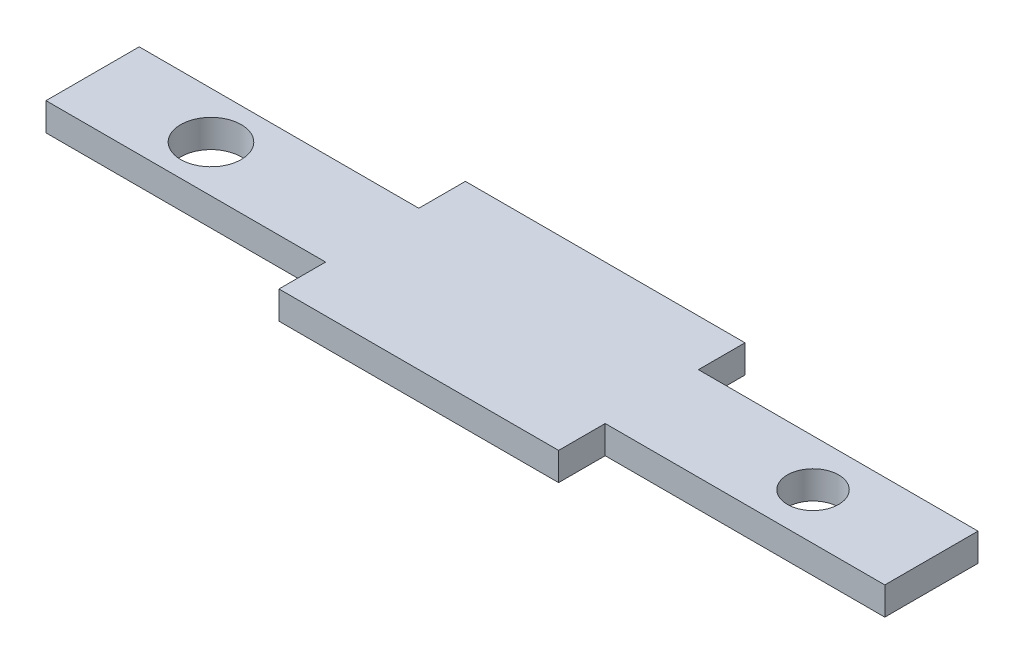
ISO-10303-21;
HEADER;
FILE_DESCRIPTION(('STEP AP214'),'2;1');
FILE_NAME('part.step','',(''),(''),'','','');
FILE_SCHEMA(('AUTOMOTIVE_DESIGN { 1 0 10303 214 1 1 1 1 }'));
ENDSEC;
DATA;
#1=APPLICATION_CONTEXT('core data for automotive mechanical design processes');
#2=APPLICATION_PROTOCOL_DEFINITION('international standard','automotive_design',2000,#1);
#3=PRODUCT_CONTEXT('',#1,'mechanical');
#4=PRODUCT('Part','Part','',(#3));
#5=PRODUCT_RELATED_PRODUCT_CATEGORY('part','',(#4));
#6=PRODUCT_DEFINITION_FORMATION('','',#4);
#7=PRODUCT_DEFINITION_CONTEXT('part definition',#1,'design');
#8=PRODUCT_DEFINITION('design','',#6,#7);
#9=PRODUCT_DEFINITION_SHAPE('','',#8);
#10=(LENGTH_UNIT() NAMED_UNIT(*) SI_UNIT(.MILLI.,.METRE.));
#11=(NAMED_UNIT(*) PLANE_ANGLE_UNIT() SI_UNIT($,.RADIAN.));
#12=(NAMED_UNIT(*) SI_UNIT($,.STERADIAN.) SOLID_ANGLE_UNIT());
#13=UNCERTAINTY_MEASURE_WITH_UNIT(LENGTH_MEASURE(1.E-05),#10,'distance_accuracy_value','');
#14=(GEOMETRIC_REPRESENTATION_CONTEXT(3) GLOBAL_UNCERTAINTY_ASSIGNED_CONTEXT((#13)) GLOBAL_UNIT_ASSIGNED_CONTEXT((#10,
#11,#12)) REPRESENTATION_CONTEXT('',''));
#15=CARTESIAN_POINT('',(0.,0.,0.));
#16=DIRECTION('',(0.,0.,1.));
#17=DIRECTION('',(1.,0.,0.));
#18=AXIS2_PLACEMENT_3D('',#15,#16,#17);
#19=CARTESIAN_POINT('',(0.,3.,0.));
#20=DIRECTION('',(0.,-1.,0.));
#21=DIRECTION('',(0.,0.,-1.));
#22=AXIS2_PLACEMENT_3D('',#19,#20,#21);
#23=PLANE('',#22);
#24=CARTESIAN_POINT('',(-19.7780658465076,3.,-5.));
#25=DIRECTION('',(0.,1.,0.));
#26=DIRECTION('',(0.,0.,1.));
#27=AXIS2_PLACEMENT_3D('',#24,#25,#26);
#28=CIRCLE('',#27,3.25);
#29=CARTESIAN_POINT('',(-19.7780658465076,3.,-1.75));
#30=VERTEX_POINT('',#29);
#31=EDGE_CURVE('E158',#30,#30,#28,.T.);
#32=ORIENTED_EDGE('',*,*,#31,.F.);
#33=EDGE_LOOP('',(#32));
#34=FACE_BOUND('',#33,.T.);
#35=DIRECTION('',(1.,0.,0.));
#36=VECTOR('',#35,1.);
#37=CARTESIAN_POINT('',(-2.47806584650756,3.,0.));
#38=LINE('',#37,#36);
#39=CARTESIAN_POINT('',(-32.4780658465076,3.,0.));
#40=VERTEX_POINT('',#39);
#41=CARTESIAN_POINT('',(-2.47806584650756,3.,0.));
#42=VERTEX_POINT('',#41);
#43=EDGE_CURVE('E177',#40,#42,#38,.T.);
#44=ORIENTED_EDGE('',*,*,#43,.T.);
#45=DIRECTION('',(0.,0.,1.));
#46=VECTOR('',#45,1.);
#47=CARTESIAN_POINT('',(-2.47806584650756,3.,4.99999999999999));
#48=LINE('',#47,#46);
#49=CARTESIAN_POINT('',(-2.47806584650756,3.,4.99999999999999));
#50=VERTEX_POINT('',#49);
#51=EDGE_CURVE('E105',#42,#50,#48,.T.);
#52=ORIENTED_EDGE('',*,*,#51,.T.);
#53=DIRECTION('',(1.,0.,0.));
#54=VECTOR('',#53,1.);
#55=CARTESIAN_POINT('',(27.5219341534924,3.,4.99999999999999));
#56=LINE('',#55,#54);
#57=CARTESIAN_POINT('',(27.5219341534924,3.,4.99999999999999));
#58=VERTEX_POINT('',#57);
#59=EDGE_CURVE('E204',#50,#58,#56,.T.);
#60=ORIENTED_EDGE('',*,*,#59,.T.);
#61=DIRECTION('',(0.,0.,-1.));
#62=VECTOR('',#61,1.);
#63=CARTESIAN_POINT('',(27.5219341534924,3.,0.));
#64=LINE('',#63,#62);
#65=CARTESIAN_POINT('',(27.5219341534924,3.,0.));
#66=VERTEX_POINT('',#65);
#67=EDGE_CURVE('E223',#58,#66,#64,.T.);
#68=ORIENTED_EDGE('',*,*,#67,.T.);
#69=DIRECTION('',(1.,0.,0.));
#70=VECTOR('',#69,1.);
#71=CARTESIAN_POINT('',(57.5219341534924,3.,0.));
#72=LINE('',#71,#70);
#73=CARTESIAN_POINT('',(57.5219341534924,3.,0.));
#74=VERTEX_POINT('',#73);
#75=EDGE_CURVE('E220',#66,#74,#72,.T.);
#76=ORIENTED_EDGE('',*,*,#75,.T.);
#77=DIRECTION('',(0.,0.,-1.));
#78=VECTOR('',#77,1.);
#79=CARTESIAN_POINT('',(57.5219341534924,3.,-10.));
#80=LINE('',#79,#78);
#81=CARTESIAN_POINT('',(57.5219341534924,3.,-10.));
#82=VERTEX_POINT('',#81);
#83=EDGE_CURVE('E222',#74,#82,#80,.T.);
#84=ORIENTED_EDGE('',*,*,#83,.T.);
#85=DIRECTION('',(-1.,0.,0.));
#86=VECTOR('',#85,1.);
#87=CARTESIAN_POINT('',(27.5219341534924,3.,-10.));
#88=LINE('',#87,#86);
#89=CARTESIAN_POINT('',(27.5219341534924,3.,-10.));
#90=VERTEX_POINT('',#89);
#91=EDGE_CURVE('E225',#82,#90,#88,.T.);
#92=ORIENTED_EDGE('',*,*,#91,.T.);
#93=DIRECTION('',(0.,0.,-1.));
#94=VECTOR('',#93,1.);
#95=CARTESIAN_POINT('',(27.5219341534924,3.,-15.));
#96=LINE('',#95,#94);
#97=CARTESIAN_POINT('',(27.5219341534924,3.,-15.));
#98=VERTEX_POINT('',#97);
#99=EDGE_CURVE('E231',#90,#98,#96,.T.);
#100=ORIENTED_EDGE('',*,*,#99,.T.);
#101=DIRECTION('',(-1.,0.,0.));
#102=VECTOR('',#101,1.);
#103=CARTESIAN_POINT('',(-2.47806584650756,3.,-15.));
#104=LINE('',#103,#102);
#105=CARTESIAN_POINT('',(-2.47806584650756,3.,-15.));
#106=VERTEX_POINT('',#105);
#107=EDGE_CURVE('E136',#98,#106,#104,.T.);
#108=ORIENTED_EDGE('',*,*,#107,.T.);
#109=DIRECTION('',(0.,0.,1.));
#110=VECTOR('',#109,1.);
#111=CARTESIAN_POINT('',(-2.47806584650756,3.,-10.));
#112=LINE('',#111,#110);
#113=CARTESIAN_POINT('',(-2.47806584650756,3.,-10.));
#114=VERTEX_POINT('',#113);
#115=EDGE_CURVE('E130',#106,#114,#112,.T.);
#116=ORIENTED_EDGE('',*,*,#115,.T.);
#117=DIRECTION('',(-1.,0.,0.));
#118=VECTOR('',#117,1.);
#119=CARTESIAN_POINT('',(-32.4780658465076,3.,-10.));
#120=LINE('',#119,#118);
#121=CARTESIAN_POINT('',(-32.4780658465076,3.,-10.));
#122=VERTEX_POINT('',#121);
#123=EDGE_CURVE('E134',#114,#122,#120,.T.);
#124=ORIENTED_EDGE('',*,*,#123,.T.);
#125=DIRECTION('',(0.,0.,1.));
#126=VECTOR('',#125,1.);
#127=CARTESIAN_POINT('',(-32.4780658465076,3.,0.));
#128=LINE('',#127,#126);
#129=EDGE_CURVE('E50',#122,#40,#128,.T.);
#130=ORIENTED_EDGE('',*,*,#129,.T.);
#131=EDGE_LOOP('',(#44,#52,#60,#68,#76,#84,#92,#100,#108,#116,#124,#130));
#132=FACE_BOUND('',#131,.T.);
#133=CARTESIAN_POINT('',(44.8219341534924,3.,-5.));
#134=DIRECTION('',(0.,1.,0.));
#135=DIRECTION('',(0.,0.,1.));
#136=AXIS2_PLACEMENT_3D('',#133,#134,#135);
#137=CIRCLE('',#136,2.75);
#138=CARTESIAN_POINT('',(44.8219341534924,3.,-2.25));
#139=VERTEX_POINT('',#138);
#140=EDGE_CURVE('E274',#139,#139,#137,.T.);
#141=ORIENTED_EDGE('',*,*,#140,.F.);
#142=EDGE_LOOP('',(#141));
#143=FACE_BOUND('',#142,.T.);
#144=ADVANCED_FACE('F33',(#34,#132,#143),#23,.F.);
#145=CARTESIAN_POINT('',(0.,0.,0.));
#146=DIRECTION('',(0.,-1.,0.));
#147=DIRECTION('',(0.,0.,-1.));
#148=AXIS2_PLACEMENT_3D('',#145,#146,#147);
#149=PLANE('',#148);
#150=CARTESIAN_POINT('',(-19.7780658465076,0.,-5.));
#151=DIRECTION('',(0.,1.,0.));
#152=DIRECTION('',(0.,0.,1.));
#153=AXIS2_PLACEMENT_3D('',#150,#151,#152);
#154=CIRCLE('',#153,3.25);
#155=CARTESIAN_POINT('',(-19.7780658465076,0.,-1.75));
#156=VERTEX_POINT('',#155);
#157=EDGE_CURVE('E279',#156,#156,#154,.T.);
#158=ORIENTED_EDGE('',*,*,#157,.T.);
#159=EDGE_LOOP('',(#158));
#160=FACE_BOUND('',#159,.T.);
#161=DIRECTION('',(1.,0.,0.));
#162=VECTOR('',#161,1.);
#163=CARTESIAN_POINT('',(-2.47806584650756,0.,0.));
#164=LINE('',#163,#162);
#165=CARTESIAN_POINT('',(-32.4780658465076,0.,0.));
#166=VERTEX_POINT('',#165);
#167=CARTESIAN_POINT('',(-2.47806584650756,0.,0.));
#168=VERTEX_POINT('',#167);
#169=EDGE_CURVE('E154',#166,#168,#164,.T.);
#170=ORIENTED_EDGE('',*,*,#169,.F.);
#171=DIRECTION('',(0.,0.,1.));
#172=VECTOR('',#171,1.);
#173=CARTESIAN_POINT('',(-32.4780658465076,0.,0.));
#174=LINE('',#173,#172);
#175=CARTESIAN_POINT('',(-32.4780658465076,0.,-10.));
#176=VERTEX_POINT('',#175);
#177=EDGE_CURVE('E97',#176,#166,#174,.T.);
#178=ORIENTED_EDGE('',*,*,#177,.F.);
#179=DIRECTION('',(-1.,0.,0.));
#180=VECTOR('',#179,1.);
#181=CARTESIAN_POINT('',(-32.4780658465076,0.,-10.));
#182=LINE('',#181,#180);
#183=CARTESIAN_POINT('',(-2.47806584650756,0.,-10.));
#184=VERTEX_POINT('',#183);
#185=EDGE_CURVE('E91',#184,#176,#182,.T.);
#186=ORIENTED_EDGE('',*,*,#185,.F.);
#187=DIRECTION('',(0.,0.,1.));
#188=VECTOR('',#187,1.);
#189=CARTESIAN_POINT('',(-2.47806584650756,0.,-10.));
#190=LINE('',#189,#188);
#191=CARTESIAN_POINT('',(-2.47806584650756,0.,-15.));
#192=VERTEX_POINT('',#191);
#193=EDGE_CURVE('E144',#192,#184,#190,.T.);
#194=ORIENTED_EDGE('',*,*,#193,.F.);
#195=DIRECTION('',(-1.,0.,0.));
#196=VECTOR('',#195,1.);
#197=CARTESIAN_POINT('',(-2.47806584650756,0.,-15.));
#198=LINE('',#197,#196);
#199=CARTESIAN_POINT('',(27.5219341534924,0.,-15.));
#200=VERTEX_POINT('',#199);
#201=EDGE_CURVE('E172',#200,#192,#198,.T.);
#202=ORIENTED_EDGE('',*,*,#201,.F.);
#203=DIRECTION('',(0.,0.,-1.));
#204=VECTOR('',#203,1.);
#205=CARTESIAN_POINT('',(27.5219341534924,0.,-15.));
#206=LINE('',#205,#204);
#207=CARTESIAN_POINT('',(27.5219341534924,0.,-10.));
#208=VERTEX_POINT('',#207);
#209=EDGE_CURVE('E170',#208,#200,#206,.T.);
#210=ORIENTED_EDGE('',*,*,#209,.F.);
#211=DIRECTION('',(-1.,0.,0.));
#212=VECTOR('',#211,1.);
#213=CARTESIAN_POINT('',(27.5219341534924,0.,-10.));
#214=LINE('',#213,#212);
#215=CARTESIAN_POINT('',(57.5219341534924,0.,-10.));
#216=VERTEX_POINT('',#215);
#217=EDGE_CURVE('E168',#216,#208,#214,.T.);
#218=ORIENTED_EDGE('',*,*,#217,.F.);
#219=DIRECTION('',(0.,0.,-1.));
#220=VECTOR('',#219,1.);
#221=CARTESIAN_POINT('',(57.5219341534924,0.,-10.));
#222=LINE('',#221,#220);
#223=CARTESIAN_POINT('',(57.5219341534924,0.,0.));
#224=VERTEX_POINT('',#223);
#225=EDGE_CURVE('E166',#224,#216,#222,.T.);
#226=ORIENTED_EDGE('',*,*,#225,.F.);
#227=DIRECTION('',(1.,0.,0.));
#228=VECTOR('',#227,1.);
#229=CARTESIAN_POINT('',(57.5219341534924,0.,0.));
#230=LINE('',#229,#228);
#231=CARTESIAN_POINT('',(27.5219341534924,0.,0.));
#232=VERTEX_POINT('',#231);
#233=EDGE_CURVE('E164',#232,#224,#230,.T.);
#234=ORIENTED_EDGE('',*,*,#233,.F.);
#235=DIRECTION('',(0.,0.,-1.));
#236=VECTOR('',#235,1.);
#237=CARTESIAN_POINT('',(27.5219341534924,0.,0.));
#238=LINE('',#237,#236);
#239=CARTESIAN_POINT('',(27.5219341534924,0.,4.99999999999999));
#240=VERTEX_POINT('',#239);
#241=EDGE_CURVE('E162',#240,#232,#238,.T.);
#242=ORIENTED_EDGE('',*,*,#241,.F.);
#243=DIRECTION('',(1.,0.,0.));
#244=VECTOR('',#243,1.);
#245=CARTESIAN_POINT('',(27.5219341534924,0.,4.99999999999999));
#246=LINE('',#245,#244);
#247=CARTESIAN_POINT('',(-2.47806584650756,0.,4.99999999999999));
#248=VERTEX_POINT('',#247);
#249=EDGE_CURVE('E160',#248,#240,#246,.T.);
#250=ORIENTED_EDGE('',*,*,#249,.F.);
#251=DIRECTION('',(0.,0.,1.));
#252=VECTOR('',#251,1.);
#253=CARTESIAN_POINT('',(-2.47806584650756,0.,4.99999999999999));
#254=LINE('',#253,#252);
#255=EDGE_CURVE('E157',#168,#248,#254,.T.);
#256=ORIENTED_EDGE('',*,*,#255,.F.);
#257=EDGE_LOOP('',(#170,#178,#186,#194,#202,#210,#218,#226,#234,#242,#250,#256));
#258=FACE_BOUND('',#257,.T.);
#259=CARTESIAN_POINT('',(44.8219341534924,0.,-5.));
#260=DIRECTION('',(0.,1.,0.));
#261=DIRECTION('',(0.,0.,1.));
#262=AXIS2_PLACEMENT_3D('',#259,#260,#261);
#263=CIRCLE('',#262,2.75);
#264=CARTESIAN_POINT('',(44.8219341534924,0.,-2.25));
#265=VERTEX_POINT('',#264);
#266=EDGE_CURVE('E277',#265,#265,#263,.T.);
#267=ORIENTED_EDGE('',*,*,#266,.T.);
#268=EDGE_LOOP('',(#267));
#269=FACE_BOUND('',#268,.T.);
#270=ADVANCED_FACE('F208',(#160,#258,#269),#149,.T.);
#271=CARTESIAN_POINT('',(-2.47806584650756,3.,0.));
#272=DIRECTION('',(0.,0.,-1.));
#273=DIRECTION('',(-1.,0.,0.));
#274=AXIS2_PLACEMENT_3D('',#271,#272,#273);
#275=PLANE('',#274);
#276=ORIENTED_EDGE('',*,*,#169,.T.);
#277=DIRECTION('',(0.,-1.,0.));
#278=VECTOR('',#277,1.);
#279=CARTESIAN_POINT('',(-2.47806584650756,3.,0.));
#280=LINE('',#279,#278);
#281=EDGE_CURVE('E11',#42,#168,#280,.T.);
#282=ORIENTED_EDGE('',*,*,#281,.F.);
#283=ORIENTED_EDGE('',*,*,#43,.F.);
#284=DIRECTION('',(0.,-1.,0.));
#285=VECTOR('',#284,1.);
#286=CARTESIAN_POINT('',(-32.4780658465076,3.,0.));
#287=LINE('',#286,#285);
#288=EDGE_CURVE('E150',#40,#166,#287,.T.);
#289=ORIENTED_EDGE('',*,*,#288,.T.);
#290=EDGE_LOOP('',(#276,#282,#283,#289));
#291=FACE_BOUND('',#290,.T.);
#292=ADVANCED_FACE('F35',(#291),#275,.F.);
#293=CARTESIAN_POINT('',(-2.47806584650756,3.,4.99999999999999));
#294=DIRECTION('',(1.,0.,0.));
#295=DIRECTION('',(0.,0.,-1.));
#296=AXIS2_PLACEMENT_3D('',#293,#294,#295);
#297=PLANE('',#296);
#298=ORIENTED_EDGE('',*,*,#255,.T.);
#299=DIRECTION('',(0.,-1.,0.));
#300=VECTOR('',#299,1.);
#301=CARTESIAN_POINT('',(-2.47806584650756,3.,4.99999999999999));
#302=LINE('',#301,#300);
#303=EDGE_CURVE('E42',#50,#248,#302,.T.);
#304=ORIENTED_EDGE('',*,*,#303,.F.);
#305=ORIENTED_EDGE('',*,*,#51,.F.);
#306=ORIENTED_EDGE('',*,*,#281,.T.);
#307=EDGE_LOOP('',(#298,#304,#305,#306));
#308=FACE_BOUND('',#307,.T.);
#309=ADVANCED_FACE('F372',(#308),#297,.F.);
#310=CARTESIAN_POINT('',(27.5219341534924,3.,4.99999999999999));
#311=DIRECTION('',(0.,0.,-1.));
#312=DIRECTION('',(-1.,0.,0.));
#313=AXIS2_PLACEMENT_3D('',#310,#311,#312);
#314=PLANE('',#313);
#315=ORIENTED_EDGE('',*,*,#249,.T.);
#316=DIRECTION('',(0.,-1.,0.));
#317=VECTOR('',#316,1.);
#318=CARTESIAN_POINT('',(27.5219341534924,3.,4.99999999999999));
#319=LINE('',#318,#317);
#320=EDGE_CURVE('E196',#58,#240,#319,.T.);
#321=ORIENTED_EDGE('',*,*,#320,.F.);
#322=ORIENTED_EDGE('',*,*,#59,.F.);
#323=ORIENTED_EDGE('',*,*,#303,.T.);
#324=EDGE_LOOP('',(#315,#321,#322,#323));
#325=FACE_BOUND('',#324,.T.);
#326=ADVANCED_FACE('F202',(#325),#314,.F.);
#327=CARTESIAN_POINT('',(27.5219341534924,3.,0.));
#328=DIRECTION('',(-1.,0.,0.));
#329=DIRECTION('',(0.,0.,1.));
#330=AXIS2_PLACEMENT_3D('',#327,#328,#329);
#331=PLANE('',#330);
#332=ORIENTED_EDGE('',*,*,#241,.T.);
#333=DIRECTION('',(0.,-1.,0.));
#334=VECTOR('',#333,1.);
#335=CARTESIAN_POINT('',(27.5219341534924,3.,0.));
#336=LINE('',#335,#334);
#337=EDGE_CURVE('E193',#66,#232,#336,.T.);
#338=ORIENTED_EDGE('',*,*,#337,.F.);
#339=ORIENTED_EDGE('',*,*,#67,.F.);
#340=ORIENTED_EDGE('',*,*,#320,.T.);
#341=EDGE_LOOP('',(#332,#338,#339,#340));
#342=FACE_BOUND('',#341,.T.);
#343=ADVANCED_FACE('F214',(#342),#331,.F.);
#344=CARTESIAN_POINT('',(57.5219341534924,3.,0.));
#345=DIRECTION('',(0.,0.,-1.));
#346=DIRECTION('',(-1.,0.,0.));
#347=AXIS2_PLACEMENT_3D('',#344,#345,#346);
#348=PLANE('',#347);
#349=ORIENTED_EDGE('',*,*,#233,.T.);
#350=DIRECTION('',(0.,-1.,0.));
#351=VECTOR('',#350,1.);
#352=CARTESIAN_POINT('',(57.5219341534924,3.,0.));
#353=LINE('',#352,#351);
#354=EDGE_CURVE('E190',#74,#224,#353,.T.);
#355=ORIENTED_EDGE('',*,*,#354,.F.);
#356=ORIENTED_EDGE('',*,*,#75,.F.);
#357=ORIENTED_EDGE('',*,*,#337,.T.);
#358=EDGE_LOOP('',(#349,#355,#356,#357));
#359=FACE_BOUND('',#358,.T.);
#360=ADVANCED_FACE('F218',(#359),#348,.F.);
#361=CARTESIAN_POINT('',(57.5219341534924,3.,-10.));
#362=DIRECTION('',(-1.,0.,0.));
#363=DIRECTION('',(0.,0.,1.));
#364=AXIS2_PLACEMENT_3D('',#361,#362,#363);
#365=PLANE('',#364);
#366=ORIENTED_EDGE('',*,*,#225,.T.);
#367=DIRECTION('',(0.,-1.,0.));
#368=VECTOR('',#367,1.);
#369=CARTESIAN_POINT('',(57.5219341534924,3.,-10.));
#370=LINE('',#369,#368);
#371=EDGE_CURVE('E187',#82,#216,#370,.T.);
#372=ORIENTED_EDGE('',*,*,#371,.F.);
#373=ORIENTED_EDGE('',*,*,#83,.F.);
#374=ORIENTED_EDGE('',*,*,#354,.T.);
#375=EDGE_LOOP('',(#366,#372,#373,#374));
#376=FACE_BOUND('',#375,.T.);
#377=ADVANCED_FACE('F337',(#376),#365,.F.);
#378=CARTESIAN_POINT('',(27.5219341534924,3.,-10.));
#379=DIRECTION('',(0.,0.,1.));
#380=DIRECTION('',(1.,0.,0.));
#381=AXIS2_PLACEMENT_3D('',#378,#379,#380);
#382=PLANE('',#381);
#383=ORIENTED_EDGE('',*,*,#217,.T.);
#384=DIRECTION('',(0.,-1.,0.));
#385=VECTOR('',#384,1.);
#386=CARTESIAN_POINT('',(27.5219341534924,3.,-10.));
#387=LINE('',#386,#385);
#388=EDGE_CURVE('E184',#90,#208,#387,.T.);
#389=ORIENTED_EDGE('',*,*,#388,.F.);
#390=ORIENTED_EDGE('',*,*,#91,.F.);
#391=ORIENTED_EDGE('',*,*,#371,.T.);
#392=EDGE_LOOP('',(#383,#389,#390,#391));
#393=FACE_BOUND('',#392,.T.);
#394=ADVANCED_FACE('F328',(#393),#382,.F.);
#395=CARTESIAN_POINT('',(27.5219341534924,3.,-15.));
#396=DIRECTION('',(-1.,0.,0.));
#397=DIRECTION('',(0.,0.,1.));
#398=AXIS2_PLACEMENT_3D('',#395,#396,#397);
#399=PLANE('',#398);
#400=ORIENTED_EDGE('',*,*,#209,.T.);
#401=DIRECTION('',(0.,-1.,0.));
#402=VECTOR('',#401,1.);
#403=CARTESIAN_POINT('',(27.5219341534924,3.,-15.));
#404=LINE('',#403,#402);
#405=EDGE_CURVE('E181',#98,#200,#404,.T.);
#406=ORIENTED_EDGE('',*,*,#405,.F.);
#407=ORIENTED_EDGE('',*,*,#99,.F.);
#408=ORIENTED_EDGE('',*,*,#388,.T.);
#409=EDGE_LOOP('',(#400,#406,#407,#408));
#410=FACE_BOUND('',#409,.T.);
#411=ADVANCED_FACE('F237',(#410),#399,.F.);
#412=CARTESIAN_POINT('',(-2.47806584650756,3.,-15.));
#413=DIRECTION('',(0.,0.,1.));
#414=DIRECTION('',(1.,0.,0.));
#415=AXIS2_PLACEMENT_3D('',#412,#413,#414);
#416=PLANE('',#415);
#417=ORIENTED_EDGE('',*,*,#201,.T.);
#418=DIRECTION('',(0.,-1.,0.));
#419=VECTOR('',#418,1.);
#420=CARTESIAN_POINT('',(-2.47806584650756,3.,-15.));
#421=LINE('',#420,#419);
#422=EDGE_CURVE('E145',#106,#192,#421,.T.);
#423=ORIENTED_EDGE('',*,*,#422,.F.);
#424=ORIENTED_EDGE('',*,*,#107,.F.);
#425=ORIENTED_EDGE('',*,*,#405,.T.);
#426=EDGE_LOOP('',(#417,#423,#424,#425));
#427=FACE_BOUND('',#426,.T.);
#428=ADVANCED_FACE('F241',(#427),#416,.F.);
#429=CARTESIAN_POINT('',(-2.47806584650756,3.,-10.));
#430=DIRECTION('',(1.,0.,0.));
#431=DIRECTION('',(0.,0.,-1.));
#432=AXIS2_PLACEMENT_3D('',#429,#430,#431);
#433=PLANE('',#432);
#434=ORIENTED_EDGE('',*,*,#193,.T.);
#435=DIRECTION('',(0.,-1.,0.));
#436=VECTOR('',#435,1.);
#437=CARTESIAN_POINT('',(-2.47806584650756,3.,-10.));
#438=LINE('',#437,#436);
#439=EDGE_CURVE('E141',#114,#184,#438,.T.);
#440=ORIENTED_EDGE('',*,*,#439,.F.);
#441=ORIENTED_EDGE('',*,*,#115,.F.);
#442=ORIENTED_EDGE('',*,*,#422,.T.);
#443=EDGE_LOOP('',(#434,#440,#441,#442));
#444=FACE_BOUND('',#443,.T.);
#445=ADVANCED_FACE('F142',(#444),#433,.F.);
#446=CARTESIAN_POINT('',(-32.4780658465076,3.,-10.));
#447=DIRECTION('',(0.,0.,1.));
#448=DIRECTION('',(1.,0.,0.));
#449=AXIS2_PLACEMENT_3D('',#446,#447,#448);
#450=PLANE('',#449);
#451=ORIENTED_EDGE('',*,*,#185,.T.);
#452=DIRECTION('',(0.,-1.,0.));
#453=VECTOR('',#452,1.);
#454=CARTESIAN_POINT('',(-32.4780658465076,3.,-10.));
#455=LINE('',#454,#453);
#456=EDGE_CURVE('E146',#122,#176,#455,.T.);
#457=ORIENTED_EDGE('',*,*,#456,.F.);
#458=ORIENTED_EDGE('',*,*,#123,.F.);
#459=ORIENTED_EDGE('',*,*,#439,.T.);
#460=EDGE_LOOP('',(#451,#457,#458,#459));
#461=FACE_BOUND('',#460,.T.);
#462=ADVANCED_FACE('F148',(#461),#450,.F.);
#463=CARTESIAN_POINT('',(-32.4780658465076,3.,0.));
#464=DIRECTION('',(1.,0.,0.));
#465=DIRECTION('',(0.,0.,-1.));
#466=AXIS2_PLACEMENT_3D('',#463,#464,#465);
#467=PLANE('',#466);
#468=ORIENTED_EDGE('',*,*,#177,.T.);
#469=ORIENTED_EDGE('',*,*,#288,.F.);
#470=ORIENTED_EDGE('',*,*,#129,.F.);
#471=ORIENTED_EDGE('',*,*,#456,.T.);
#472=EDGE_LOOP('',(#468,#469,#470,#471));
#473=FACE_BOUND('',#472,.T.);
#474=ADVANCED_FACE('F245',(#473),#467,.F.);
#475=CARTESIAN_POINT('',(-19.7780658465076,3.,-5.));
#476=DIRECTION('',(0.,-1.,0.));
#477=DIRECTION('',(0.,0.,-1.));
#478=AXIS2_PLACEMENT_3D('',#475,#476,#477);
#479=CYLINDRICAL_SURFACE('',#478,3.25);
#480=ORIENTED_EDGE('',*,*,#31,.T.);
#481=EDGE_LOOP('',(#480));
#482=FACE_BOUND('',#481,.T.);
#483=ORIENTED_EDGE('',*,*,#157,.F.);
#484=EDGE_LOOP('',(#483));
#485=FACE_BOUND('',#484,.T.);
#486=ADVANCED_FACE('F247',(#482,#485),#479,.F.);
#487=CARTESIAN_POINT('',(44.8219341534924,3.,-5.));
#488=DIRECTION('',(0.,-1.,0.));
#489=DIRECTION('',(0.,0.,-1.));
#490=AXIS2_PLACEMENT_3D('',#487,#488,#489);
#491=CYLINDRICAL_SURFACE('',#490,2.75);
#492=ORIENTED_EDGE('',*,*,#140,.T.);
#493=EDGE_LOOP('',(#492));
#494=FACE_BOUND('',#493,.T.);
#495=ORIENTED_EDGE('',*,*,#266,.F.);
#496=EDGE_LOOP('',(#495));
#497=FACE_BOUND('',#496,.T.);
#498=ADVANCED_FACE('F253',(#494,#497),#491,.F.);
#499=CLOSED_SHELL('',(#144,#270,#292,#309,#326,#343,#360,#377,#394,#411,#428,#445,#462,#474,
#486,#498));
#500=MANIFOLD_SOLID_BREP('B2',#499);
#501=ADVANCED_BREP_SHAPE_REPRESENTATION('',(#18,#500),#14);
#502=SHAPE_DEFINITION_REPRESENTATION(#9,#501);
ENDSEC;
END-ISO-10303-21;
